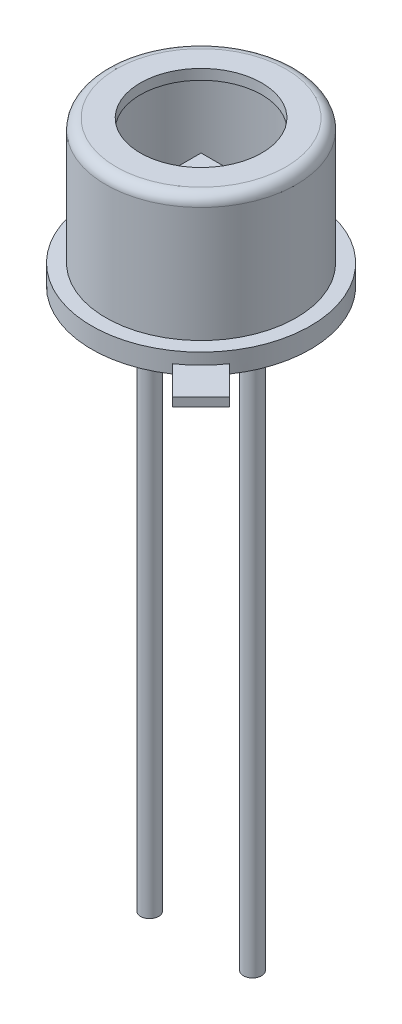
ISO-10303-21;
HEADER;
FILE_DESCRIPTION(('STEP AP214'),'2;1');
FILE_NAME('part.step','',(''),(''),'','','');
FILE_SCHEMA(('AUTOMOTIVE_DESIGN { 1 0 10303 214 1 1 1 1 }'));
ENDSEC;
DATA;
#1=APPLICATION_CONTEXT('core data for automotive mechanical design processes');
#2=APPLICATION_PROTOCOL_DEFINITION('international standard','automotive_design',2000,#1);
#3=PRODUCT_CONTEXT('',#1,'mechanical');
#4=PRODUCT('Part','Part','',(#3));
#5=PRODUCT_RELATED_PRODUCT_CATEGORY('part','',(#4));
#6=PRODUCT_DEFINITION_FORMATION('','',#4);
#7=PRODUCT_DEFINITION_CONTEXT('part definition',#1,'design');
#8=PRODUCT_DEFINITION('design','',#6,#7);
#9=PRODUCT_DEFINITION_SHAPE('','',#8);
#10=(LENGTH_UNIT() NAMED_UNIT(*) SI_UNIT(.MILLI.,.METRE.));
#11=(NAMED_UNIT(*) PLANE_ANGLE_UNIT() SI_UNIT($,.RADIAN.));
#12=(NAMED_UNIT(*) SI_UNIT($,.STERADIAN.) SOLID_ANGLE_UNIT());
#13=UNCERTAINTY_MEASURE_WITH_UNIT(LENGTH_MEASURE(1.E-05),#10,'distance_accuracy_value','');
#14=(GEOMETRIC_REPRESENTATION_CONTEXT(3) GLOBAL_UNCERTAINTY_ASSIGNED_CONTEXT((#13)) GLOBAL_UNIT_ASSIGNED_CONTEXT((#10,
#11,#12)) REPRESENTATION_CONTEXT('',''));
#15=CARTESIAN_POINT('',(0.,0.,0.));
#16=DIRECTION('',(0.,0.,1.));
#17=DIRECTION('',(1.,0.,0.));
#18=AXIS2_PLACEMENT_3D('',#15,#16,#17);
#19=CARTESIAN_POINT('',(-0.55,2.25,0.55));
#20=DIRECTION('',(1.,0.,0.));
#21=DIRECTION('',(0.,0.,-1.));
#22=AXIS2_PLACEMENT_3D('',#19,#20,#21);
#23=PLANE('',#22);
#24=DIRECTION('',(0.,0.,-1.));
#25=VECTOR('',#24,1.);
#26=CARTESIAN_POINT('',(-0.55,2.3,0.55));
#27=LINE('',#26,#25);
#28=CARTESIAN_POINT('',(-0.55,2.3,0.55));
#29=VERTEX_POINT('',#28);
#30=CARTESIAN_POINT('',(-0.55,2.3,-0.55));
#31=VERTEX_POINT('',#30);
#32=EDGE_CURVE('E111',#29,#31,#27,.T.);
#33=ORIENTED_EDGE('',*,*,#32,.T.);
#34=DIRECTION('',(0.,1.,0.));
#35=VECTOR('',#34,1.);
#36=CARTESIAN_POINT('',(-0.55,2.25,-0.55));
#37=LINE('',#36,#35);
#38=CARTESIAN_POINT('',(-0.55,2.25,-0.55));
#39=VERTEX_POINT('',#38);
#40=EDGE_CURVE('E12',#39,#31,#37,.T.);
#41=ORIENTED_EDGE('',*,*,#40,.F.);
#42=DIRECTION('',(0.,0.,-1.));
#43=VECTOR('',#42,1.);
#44=CARTESIAN_POINT('',(-0.55,2.25,0.55));
#45=LINE('',#44,#43);
#46=CARTESIAN_POINT('',(-0.55,2.25,0.55));
#47=VERTEX_POINT('',#46);
#48=EDGE_CURVE('E99',#47,#39,#45,.T.);
#49=ORIENTED_EDGE('',*,*,#48,.F.);
#50=DIRECTION('',(0.,1.,0.));
#51=VECTOR('',#50,1.);
#52=CARTESIAN_POINT('',(-0.55,2.25,0.55));
#53=LINE('',#52,#51);
#54=EDGE_CURVE('E107',#47,#29,#53,.T.);
#55=ORIENTED_EDGE('',*,*,#54,.T.);
#56=EDGE_LOOP('',(#33,#41,#49,#55));
#57=FACE_BOUND('',#56,.T.);
#58=ADVANCED_FACE('F48',(#57),#23,.F.);
#59=CARTESIAN_POINT('',(-0.55,2.25,-0.55));
#60=DIRECTION('',(0.,0.,1.));
#61=DIRECTION('',(1.,0.,0.));
#62=AXIS2_PLACEMENT_3D('',#59,#60,#61);
#63=PLANE('',#62);
#64=DIRECTION('',(1.,0.,0.));
#65=VECTOR('',#64,1.);
#66=CARTESIAN_POINT('',(-0.55,2.3,-0.55));
#67=LINE('',#66,#65);
#68=CARTESIAN_POINT('',(0.55,2.3,-0.55));
#69=VERTEX_POINT('',#68);
#70=EDGE_CURVE('E103',#31,#69,#67,.T.);
#71=ORIENTED_EDGE('',*,*,#70,.T.);
#72=DIRECTION('',(0.,1.,0.));
#73=VECTOR('',#72,1.);
#74=CARTESIAN_POINT('',(0.55,2.25,-0.55));
#75=LINE('',#74,#73);
#76=CARTESIAN_POINT('',(0.55,2.25,-0.55));
#77=VERTEX_POINT('',#76);
#78=EDGE_CURVE('E56',#77,#69,#75,.T.);
#79=ORIENTED_EDGE('',*,*,#78,.F.);
#80=DIRECTION('',(1.,0.,0.));
#81=VECTOR('',#80,1.);
#82=CARTESIAN_POINT('',(-0.55,2.25,-0.55));
#83=LINE('',#82,#81);
#84=EDGE_CURVE('E94',#39,#77,#83,.T.);
#85=ORIENTED_EDGE('',*,*,#84,.F.);
#86=ORIENTED_EDGE('',*,*,#40,.T.);
#87=EDGE_LOOP('',(#71,#79,#85,#86));
#88=FACE_BOUND('',#87,.T.);
#89=ADVANCED_FACE('F102',(#88),#63,.F.);
#90=CARTESIAN_POINT('',(0.55,2.25,0.55));
#91=DIRECTION('',(-1.,0.,0.));
#92=DIRECTION('',(0.,0.,1.));
#93=AXIS2_PLACEMENT_3D('',#90,#91,#92);
#94=PLANE('',#93);
#95=DIRECTION('',(0.,0.,1.));
#96=VECTOR('',#95,1.);
#97=CARTESIAN_POINT('',(0.55,2.3,0.55));
#98=LINE('',#97,#96);
#99=CARTESIAN_POINT('',(0.55,2.3,0.55));
#100=VERTEX_POINT('',#99);
#101=EDGE_CURVE('E81',#69,#100,#98,.T.);
#102=ORIENTED_EDGE('',*,*,#101,.T.);
#103=DIRECTION('',(0.,1.,0.));
#104=VECTOR('',#103,1.);
#105=CARTESIAN_POINT('',(0.55,2.25,0.55));
#106=LINE('',#105,#104);
#107=CARTESIAN_POINT('',(0.55,2.25,0.55));
#108=VERTEX_POINT('',#107);
#109=EDGE_CURVE('E104',#108,#100,#106,.T.);
#110=ORIENTED_EDGE('',*,*,#109,.F.);
#111=DIRECTION('',(0.,0.,1.));
#112=VECTOR('',#111,1.);
#113=CARTESIAN_POINT('',(0.55,2.25,0.55));
#114=LINE('',#113,#112);
#115=EDGE_CURVE('E97',#77,#108,#114,.T.);
#116=ORIENTED_EDGE('',*,*,#115,.F.);
#117=ORIENTED_EDGE('',*,*,#78,.T.);
#118=EDGE_LOOP('',(#102,#110,#116,#117));
#119=FACE_BOUND('',#118,.T.);
#120=ADVANCED_FACE('F105',(#119),#94,.F.);
#121=CARTESIAN_POINT('',(-0.55,2.25,0.55));
#122=DIRECTION('',(0.,0.,-1.));
#123=DIRECTION('',(-1.,0.,0.));
#124=AXIS2_PLACEMENT_3D('',#121,#122,#123);
#125=PLANE('',#124);
#126=DIRECTION('',(-1.,0.,0.));
#127=VECTOR('',#126,1.);
#128=CARTESIAN_POINT('',(-0.55,2.3,0.55));
#129=LINE('',#128,#127);
#130=EDGE_CURVE('E87',#100,#29,#129,.T.);
#131=ORIENTED_EDGE('',*,*,#130,.T.);
#132=ORIENTED_EDGE('',*,*,#54,.F.);
#133=DIRECTION('',(-1.,0.,0.));
#134=VECTOR('',#133,1.);
#135=CARTESIAN_POINT('',(-0.55,2.25,0.55));
#136=LINE('',#135,#134);
#137=EDGE_CURVE('E64',#108,#47,#136,.T.);
#138=ORIENTED_EDGE('',*,*,#137,.F.);
#139=ORIENTED_EDGE('',*,*,#109,.T.);
#140=EDGE_LOOP('',(#131,#132,#138,#139));
#141=FACE_BOUND('',#140,.T.);
#142=ADVANCED_FACE('F118',(#141),#125,.F.);
#143=CARTESIAN_POINT('',(-0.55,2.25,-0.55));
#144=DIRECTION('',(0.,-1.,0.));
#145=DIRECTION('',(0.,0.,-1.));
#146=AXIS2_PLACEMENT_3D('',#143,#144,#145);
#147=PLANE('',#146);
#148=ORIENTED_EDGE('',*,*,#48,.T.);
#149=ORIENTED_EDGE('',*,*,#84,.T.);
#150=ORIENTED_EDGE('',*,*,#115,.T.);
#151=ORIENTED_EDGE('',*,*,#137,.T.);
#152=EDGE_LOOP('',(#148,#149,#150,#151));
#153=FACE_BOUND('',#152,.T.);
#154=ADVANCED_FACE('F95',(#153),#147,.T.);
#155=CARTESIAN_POINT('',(-0.55,2.3,-0.55));
#156=DIRECTION('',(0.,-1.,0.));
#157=DIRECTION('',(0.,0.,-1.));
#158=AXIS2_PLACEMENT_3D('',#155,#156,#157);
#159=PLANE('',#158);
#160=ORIENTED_EDGE('',*,*,#32,.F.);
#161=ORIENTED_EDGE('',*,*,#130,.F.);
#162=ORIENTED_EDGE('',*,*,#101,.F.);
#163=ORIENTED_EDGE('',*,*,#70,.F.);
#164=EDGE_LOOP('',(#160,#161,#162,#163));
#165=FACE_BOUND('',#164,.T.);
#166=ADVANCED_FACE('F121',(#165),#159,.F.);
#167=CLOSED_SHELL('',(#58,#89,#120,#142,#154,#166));
#168=MANIFOLD_SOLID_BREP('B2',#167);
#169=CARTESIAN_POINT('',(2.7,0.,0.));
#170=DIRECTION('',(0.,1.,0.));
#171=DIRECTION('',(0.,0.,1.));
#172=AXIS2_PLACEMENT_3D('',#169,#170,#171);
#173=PLANE('',#172);
#174=CARTESIAN_POINT('',(1.27,0.,0.));
#175=DIRECTION('',(0.,-1.,0.));
#176=DIRECTION('',(0.,0.,-1.));
#177=AXIS2_PLACEMENT_3D('',#174,#175,#176);
#178=CIRCLE('',#177,0.225);
#179=CARTESIAN_POINT('',(1.27,0.,-0.225));
#180=VERTEX_POINT('',#179);
#181=EDGE_CURVE('E280',#180,#180,#178,.F.);
#182=ORIENTED_EDGE('',*,*,#181,.T.);
#183=EDGE_LOOP('',(#182));
#184=FACE_BOUND('',#183,.T.);
#185=CARTESIAN_POINT('',(0.,0.,0.));
#186=DIRECTION('',(0.,-1.,0.));
#187=DIRECTION('',(0.,0.,-1.));
#188=AXIS2_PLACEMENT_3D('',#185,#186,#187);
#189=CIRCLE('',#188,2.7);
#190=CARTESIAN_POINT('',(1.52261291333609,0.,2.22971969452265));
#191=VERTEX_POINT('',#190);
#192=CARTESIAN_POINT('',(2.22971969452265,0.,1.5226129133361));
#193=VERTEX_POINT('',#192);
#194=EDGE_CURVE('E250',#191,#193,#189,.T.);
#195=ORIENTED_EDGE('',*,*,#194,.T.);
#196=DIRECTION('',(0.707106781186546,0.,0.707106781186549));
#197=VECTOR('',#196,1.);
#198=CARTESIAN_POINT('',(2.22971969452265,0.,1.5226129133361));
#199=LINE('',#198,#197);
#200=CARTESIAN_POINT('',(2.93682647570919,0.,2.22971969452265));
#201=VERTEX_POINT('',#200);
#202=EDGE_CURVE('E227',#193,#201,#199,.T.);
#203=ORIENTED_EDGE('',*,*,#202,.T.);
#204=DIRECTION('',(-0.707106781186549,0.,0.707106781186547));
#205=VECTOR('',#204,1.);
#206=CARTESIAN_POINT('',(2.22971969452264,0.,2.93682647570919));
#207=LINE('',#206,#205);
#208=CARTESIAN_POINT('',(2.22971969452264,0.,2.93682647570919));
#209=VERTEX_POINT('',#208);
#210=EDGE_CURVE('E270',#201,#209,#207,.T.);
#211=ORIENTED_EDGE('',*,*,#210,.T.);
#212=DIRECTION('',(-0.707106781186553,0.,-0.707106781186542));
#213=VECTOR('',#212,1.);
#214=CARTESIAN_POINT('',(1.52261291333609,0.,2.22971969452265));
#215=LINE('',#214,#213);
#216=EDGE_CURVE('E188',#209,#191,#215,.T.);
#217=ORIENTED_EDGE('',*,*,#216,.T.);
#218=EDGE_LOOP('',(#195,#203,#211,#217));
#219=FACE_BOUND('',#218,.T.);
#220=CARTESIAN_POINT('',(-1.27,0.,0.));
#221=DIRECTION('',(0.,1.,0.));
#222=DIRECTION('',(0.,0.,1.));
#223=AXIS2_PLACEMENT_3D('',#220,#221,#222);
#224=CIRCLE('',#223,0.225);
#225=CARTESIAN_POINT('',(-1.27,0.,0.225));
#226=VERTEX_POINT('',#225);
#227=EDGE_CURVE('E46',#226,#226,#224,.F.);
#228=ORIENTED_EDGE('',*,*,#227,.F.);
#229=EDGE_LOOP('',(#228));
#230=FACE_BOUND('',#229,.T.);
#231=ADVANCED_FACE('F173',(#184,#219,#230),#173,.F.);
#232=CARTESIAN_POINT('',(2.096,3.6,0.));
#233=DIRECTION('',(0.,1.,0.));
#234=DIRECTION('',(0.,0.,1.));
#235=AXIS2_PLACEMENT_3D('',#232,#233,#234);
#236=PLANE('',#235);
#237=CARTESIAN_POINT('',(0.,3.6,0.));
#238=DIRECTION('',(0.,-1.,0.));
#239=DIRECTION('',(0.,0.,-1.));
#240=AXIS2_PLACEMENT_3D('',#237,#238,#239);
#241=CIRCLE('',#240,1.5);
#242=CARTESIAN_POINT('',(0.,3.6,-1.5));
#243=VERTEX_POINT('',#242);
#244=EDGE_CURVE('E240',#243,#243,#241,.T.);
#245=ORIENTED_EDGE('',*,*,#244,.T.);
#246=EDGE_LOOP('',(#245));
#247=FACE_BOUND('',#246,.T.);
#248=CARTESIAN_POINT('',(0.,3.6,0.));
#249=DIRECTION('',(0.,-1.,0.));
#250=DIRECTION('',(0.,0.,-1.));
#251=AXIS2_PLACEMENT_3D('',#248,#249,#250);
#252=CIRCLE('',#251,2.096);
#253=CARTESIAN_POINT('',(0.,3.6,-2.096));
#254=VERTEX_POINT('',#253);
#255=EDGE_CURVE('E261',#254,#254,#252,.T.);
#256=ORIENTED_EDGE('',*,*,#255,.F.);
#257=EDGE_LOOP('',(#256));
#258=FACE_BOUND('',#257,.T.);
#259=ADVANCED_FACE('F175',(#247,#258),#236,.T.);
#260=CARTESIAN_POINT('',(0.,0.,0.));
#261=DIRECTION('',(0.,-1.,0.));
#262=DIRECTION('',(0.,0.,-1.));
#263=AXIS2_PLACEMENT_3D('',#260,#261,#262);
#264=CYLINDRICAL_SURFACE('',#263,1.5);
#265=ORIENTED_EDGE('',*,*,#244,.F.);
#266=EDGE_LOOP('',(#265));
#267=FACE_BOUND('',#266,.T.);
#268=CARTESIAN_POINT('',(0.,3.346,0.));
#269=DIRECTION('',(0.,-1.,0.));
#270=DIRECTION('',(0.,0.,-1.));
#271=AXIS2_PLACEMENT_3D('',#268,#269,#270);
#272=CIRCLE('',#271,1.5);
#273=CARTESIAN_POINT('',(0.,3.346,-1.5));
#274=VERTEX_POINT('',#273);
#275=EDGE_CURVE('E242',#274,#274,#272,.T.);
#276=ORIENTED_EDGE('',*,*,#275,.T.);
#277=EDGE_LOOP('',(#276));
#278=FACE_BOUND('',#277,.T.);
#279=ADVANCED_FACE('F303',(#267,#278),#264,.F.);
#280=CARTESIAN_POINT('',(2.096,3.346,0.));
#281=DIRECTION('',(0.,1.,0.));
#282=DIRECTION('',(0.,0.,1.));
#283=AXIS2_PLACEMENT_3D('',#280,#281,#282);
#284=PLANE('',#283);
#285=ORIENTED_EDGE('',*,*,#275,.F.);
#286=EDGE_LOOP('',(#285));
#287=FACE_BOUND('',#286,.T.);
#288=CARTESIAN_POINT('',(0.,3.346,0.));
#289=DIRECTION('',(0.,-1.,0.));
#290=DIRECTION('',(0.,0.,-1.));
#291=AXIS2_PLACEMENT_3D('',#288,#289,#290);
#292=CIRCLE('',#291,2.096);
#293=CARTESIAN_POINT('',(0.,3.346,-2.096));
#294=VERTEX_POINT('',#293);
#295=EDGE_CURVE('E247',#294,#294,#292,.T.);
#296=ORIENTED_EDGE('',*,*,#295,.T.);
#297=EDGE_LOOP('',(#296));
#298=FACE_BOUND('',#297,.T.);
#299=ADVANCED_FACE('F311',(#287,#298),#284,.F.);
#300=CARTESIAN_POINT('',(0.,0.,0.));
#301=DIRECTION('',(0.,-1.,0.));
#302=DIRECTION('',(0.,0.,-1.));
#303=AXIS2_PLACEMENT_3D('',#300,#301,#302);
#304=CYLINDRICAL_SURFACE('',#303,2.096);
#305=ORIENTED_EDGE('',*,*,#295,.F.);
#306=EDGE_LOOP('',(#305));
#307=FACE_BOUND('',#306,.T.);
#308=CARTESIAN_POINT('',(0.,0.246,0.));
#309=DIRECTION('',(0.,1.,0.));
#310=DIRECTION('',(0.,0.,1.));
#311=AXIS2_PLACEMENT_3D('',#308,#309,#310);
#312=CIRCLE('',#311,2.096);
#313=CARTESIAN_POINT('',(0.,0.246,2.096));
#314=VERTEX_POINT('',#313);
#315=EDGE_CURVE('E264',#314,#314,#312,.F.);
#316=ORIENTED_EDGE('',*,*,#315,.T.);
#317=EDGE_LOOP('',(#316));
#318=FACE_BOUND('',#317,.T.);
#319=ADVANCED_FACE('F308',(#307,#318),#304,.F.);
#320=CARTESIAN_POINT('',(0.,0.,0.));
#321=DIRECTION('',(0.,-1.,0.));
#322=DIRECTION('',(0.,0.,-1.));
#323=AXIS2_PLACEMENT_3D('',#320,#321,#322);
#324=CYLINDRICAL_SURFACE('',#323,2.7);
#325=DIRECTION('',(0.,-1.,0.));
#326=VECTOR('',#325,1.);
#327=CARTESIAN_POINT('',(2.22971969452265,0.22,1.5226129133361));
#328=LINE('',#327,#326);
#329=CARTESIAN_POINT('',(2.22971969452265,0.22,1.5226129133361));
#330=VERTEX_POINT('',#329);
#331=EDGE_CURVE('E222',#330,#193,#328,.T.);
#332=ORIENTED_EDGE('',*,*,#331,.T.);
#333=ORIENTED_EDGE('',*,*,#194,.F.);
#334=DIRECTION('',(0.,-1.,0.));
#335=VECTOR('',#334,1.);
#336=CARTESIAN_POINT('',(1.52261291333609,0.22,2.22971969452265));
#337=LINE('',#336,#335);
#338=CARTESIAN_POINT('',(1.52261291333609,0.22,2.22971969452265));
#339=VERTEX_POINT('',#338);
#340=EDGE_CURVE('E231',#339,#191,#337,.T.);
#341=ORIENTED_EDGE('',*,*,#340,.F.);
#342=CARTESIAN_POINT('',(0.,0.22,0.));
#343=DIRECTION('',(0.,1.,0.));
#344=DIRECTION('',(0.,0.,1.));
#345=AXIS2_PLACEMENT_3D('',#342,#343,#344);
#346=CIRCLE('',#345,2.7);
#347=EDGE_CURVE('E181',#330,#339,#346,.F.);
#348=ORIENTED_EDGE('',*,*,#347,.F.);
#349=EDGE_LOOP('',(#332,#333,#341,#348));
#350=FACE_BOUND('',#349,.T.);
#351=CARTESIAN_POINT('',(0.,0.5,0.));
#352=DIRECTION('',(0.,-1.,0.));
#353=DIRECTION('',(0.,0.,-1.));
#354=AXIS2_PLACEMENT_3D('',#351,#352,#353);
#355=CIRCLE('',#354,2.7);
#356=CARTESIAN_POINT('',(0.,0.5,-2.7));
#357=VERTEX_POINT('',#356);
#358=EDGE_CURVE('E252',#357,#357,#355,.T.);
#359=ORIENTED_EDGE('',*,*,#358,.T.);
#360=EDGE_LOOP('',(#359));
#361=FACE_BOUND('',#360,.T.);
#362=ADVANCED_FACE('F238',(#350,#361),#324,.T.);
#363=CARTESIAN_POINT('',(2.7,0.5,0.));
#364=DIRECTION('',(0.,1.,0.));
#365=DIRECTION('',(0.,0.,1.));
#366=AXIS2_PLACEMENT_3D('',#363,#364,#365);
#367=PLANE('',#366);
#368=CARTESIAN_POINT('',(0.,0.5,0.));
#369=DIRECTION('',(0.,-1.,0.));
#370=DIRECTION('',(0.,0.,-1.));
#371=AXIS2_PLACEMENT_3D('',#368,#369,#370);
#372=CIRCLE('',#371,2.35);
#373=CARTESIAN_POINT('',(0.,0.5,-2.35));
#374=VERTEX_POINT('',#373);
#375=EDGE_CURVE('E255',#374,#374,#372,.T.);
#376=ORIENTED_EDGE('',*,*,#375,.T.);
#377=EDGE_LOOP('',(#376));
#378=FACE_BOUND('',#377,.T.);
#379=ORIENTED_EDGE('',*,*,#358,.F.);
#380=EDGE_LOOP('',(#379));
#381=FACE_BOUND('',#380,.T.);
#382=ADVANCED_FACE('F344',(#378,#381),#367,.T.);
#383=CARTESIAN_POINT('',(0.,0.,0.));
#384=DIRECTION('',(0.,-1.,0.));
#385=DIRECTION('',(0.,0.,-1.));
#386=AXIS2_PLACEMENT_3D('',#383,#384,#385);
#387=CYLINDRICAL_SURFACE('',#386,2.35);
#388=CARTESIAN_POINT('',(0.,3.346,0.));
#389=DIRECTION('',(0.,-1.,0.));
#390=DIRECTION('',(0.,0.,-1.));
#391=AXIS2_PLACEMENT_3D('',#388,#389,#390);
#392=CIRCLE('',#391,2.35);
#393=CARTESIAN_POINT('',(0.,3.346,-2.35));
#394=VERTEX_POINT('',#393);
#395=EDGE_CURVE('E258',#394,#394,#392,.T.);
#396=ORIENTED_EDGE('',*,*,#395,.T.);
#397=EDGE_LOOP('',(#396));
#398=FACE_BOUND('',#397,.T.);
#399=ORIENTED_EDGE('',*,*,#375,.F.);
#400=EDGE_LOOP('',(#399));
#401=FACE_BOUND('',#400,.T.);
#402=ADVANCED_FACE('F338',(#398,#401),#387,.T.);
#403=CARTESIAN_POINT('',(0.,3.346,0.));
#404=DIRECTION('',(0.,-1.,0.));
#405=DIRECTION('',(0.,0.,-1.));
#406=AXIS2_PLACEMENT_3D('',#403,#404,#405);
#407=TOROIDAL_SURFACE('',#406,2.096,0.254);
#408=ORIENTED_EDGE('',*,*,#255,.T.);
#409=EDGE_LOOP('',(#408));
#410=FACE_BOUND('',#409,.T.);
#411=ORIENTED_EDGE('',*,*,#395,.F.);
#412=EDGE_LOOP('',(#411));
#413=FACE_BOUND('',#412,.T.);
#414=ADVANCED_FACE('F330',(#410,#413),#407,.T.);
#415=CARTESIAN_POINT('',(2.7,0.246,0.));
#416=DIRECTION('',(0.,1.,0.));
#417=DIRECTION('',(0.,0.,1.));
#418=AXIS2_PLACEMENT_3D('',#415,#416,#417);
#419=PLANE('',#418);
#420=ORIENTED_EDGE('',*,*,#315,.F.);
#421=EDGE_LOOP('',(#420));
#422=FACE_BOUND('',#421,.T.);
#423=ADVANCED_FACE('F327',(#422),#419,.T.);
#424=CARTESIAN_POINT('',(1.52261291333609,0.22,2.22971969452265));
#425=DIRECTION('',(-0.707106781186542,0.,0.707106781186553));
#426=DIRECTION('',(0.707106781186553,0.,0.707106781186542));
#427=AXIS2_PLACEMENT_3D('',#424,#425,#426);
#428=PLANE('',#427);
#429=ORIENTED_EDGE('',*,*,#216,.F.);
#430=DIRECTION('',(0.,-1.,0.));
#431=VECTOR('',#430,1.);
#432=CARTESIAN_POINT('',(2.22971969452264,0.22,2.93682647570919));
#433=LINE('',#432,#431);
#434=CARTESIAN_POINT('',(2.22971969452264,0.22,2.93682647570919));
#435=VERTEX_POINT('',#434);
#436=EDGE_CURVE('E196',#435,#209,#433,.T.);
#437=ORIENTED_EDGE('',*,*,#436,.F.);
#438=DIRECTION('',(-0.707106781186553,0.,-0.707106781186542));
#439=VECTOR('',#438,1.);
#440=CARTESIAN_POINT('',(1.52261291333609,0.22,2.22971969452265));
#441=LINE('',#440,#439);
#442=EDGE_CURVE('E235',#435,#339,#441,.T.);
#443=ORIENTED_EDGE('',*,*,#442,.T.);
#444=ORIENTED_EDGE('',*,*,#340,.T.);
#445=EDGE_LOOP('',(#429,#437,#443,#444));
#446=FACE_BOUND('',#445,.T.);
#447=ADVANCED_FACE('F329',(#446),#428,.T.);
#448=CARTESIAN_POINT('',(2.22971969452264,0.22,2.93682647570919));
#449=DIRECTION('',(0.707106781186547,0.,0.707106781186548));
#450=DIRECTION('',(0.707106781186548,0.,-0.707106781186547));
#451=AXIS2_PLACEMENT_3D('',#448,#449,#450);
#452=PLANE('',#451);
#453=ORIENTED_EDGE('',*,*,#210,.F.);
#454=DIRECTION('',(0.,-1.,0.));
#455=VECTOR('',#454,1.);
#456=CARTESIAN_POINT('',(2.93682647570919,0.22,2.22971969452265));
#457=LINE('',#456,#455);
#458=CARTESIAN_POINT('',(2.93682647570919,0.22,2.22971969452265));
#459=VERTEX_POINT('',#458);
#460=EDGE_CURVE('E230',#459,#201,#457,.T.);
#461=ORIENTED_EDGE('',*,*,#460,.F.);
#462=DIRECTION('',(-0.707106781186549,0.,0.707106781186547));
#463=VECTOR('',#462,1.);
#464=CARTESIAN_POINT('',(2.22971969452264,0.22,2.93682647570919));
#465=LINE('',#464,#463);
#466=EDGE_CURVE('E234',#459,#435,#465,.T.);
#467=ORIENTED_EDGE('',*,*,#466,.T.);
#468=ORIENTED_EDGE('',*,*,#436,.T.);
#469=EDGE_LOOP('',(#453,#461,#467,#468));
#470=FACE_BOUND('',#469,.T.);
#471=ADVANCED_FACE('F336',(#470),#452,.T.);
#472=CARTESIAN_POINT('',(2.22971969452265,0.22,1.5226129133361));
#473=DIRECTION('',(0.707106781186549,0.,-0.707106781186546));
#474=DIRECTION('',(-0.707106781186546,0.,-0.707106781186549));
#475=AXIS2_PLACEMENT_3D('',#472,#473,#474);
#476=PLANE('',#475);
#477=ORIENTED_EDGE('',*,*,#202,.F.);
#478=ORIENTED_EDGE('',*,*,#331,.F.);
#479=DIRECTION('',(0.707106781186546,0.,0.707106781186549));
#480=VECTOR('',#479,1.);
#481=CARTESIAN_POINT('',(2.22971969452265,0.22,1.5226129133361));
#482=LINE('',#481,#480);
#483=EDGE_CURVE('E224',#330,#459,#482,.T.);
#484=ORIENTED_EDGE('',*,*,#483,.T.);
#485=ORIENTED_EDGE('',*,*,#460,.T.);
#486=EDGE_LOOP('',(#477,#478,#484,#485));
#487=FACE_BOUND('',#486,.T.);
#488=ADVANCED_FACE('F223',(#487),#476,.T.);
#489=CARTESIAN_POINT('',(2.22971969452264,0.22,2.93682647570919));
#490=DIRECTION('',(0.,1.,0.));
#491=DIRECTION('',(0.,0.,1.));
#492=AXIS2_PLACEMENT_3D('',#489,#490,#491);
#493=PLANE('',#492);
#494=ORIENTED_EDGE('',*,*,#483,.F.);
#495=ORIENTED_EDGE('',*,*,#347,.T.);
#496=ORIENTED_EDGE('',*,*,#442,.F.);
#497=ORIENTED_EDGE('',*,*,#466,.F.);
#498=EDGE_LOOP('',(#494,#495,#496,#497));
#499=FACE_BOUND('',#498,.T.);
#500=ADVANCED_FACE('F233',(#499),#493,.T.);
#501=CARTESIAN_POINT('',(-1.27,-14.,0.));
#502=DIRECTION('',(0.,1.,0.));
#503=DIRECTION('',(0.,0.,1.));
#504=AXIS2_PLACEMENT_3D('',#501,#502,#503);
#505=CYLINDRICAL_SURFACE('',#504,0.225);
#506=CARTESIAN_POINT('',(-1.27,-14.,0.));
#507=DIRECTION('',(0.,-1.,0.));
#508=DIRECTION('',(0.,0.,-1.));
#509=AXIS2_PLACEMENT_3D('',#506,#507,#508);
#510=CIRCLE('',#509,0.225);
#511=CARTESIAN_POINT('',(-1.27,-14.,-0.225));
#512=VERTEX_POINT('',#511);
#513=EDGE_CURVE('E274',#512,#512,#510,.T.);
#514=ORIENTED_EDGE('',*,*,#513,.F.);
#515=EDGE_LOOP('',(#514));
#516=FACE_BOUND('',#515,.T.);
#517=ORIENTED_EDGE('',*,*,#227,.T.);
#518=EDGE_LOOP('',(#517));
#519=FACE_BOUND('',#518,.T.);
#520=ADVANCED_FACE('F426',(#516,#519),#505,.T.);
#521=CARTESIAN_POINT('',(0.,-14.,0.));
#522=DIRECTION('',(0.,-1.,0.));
#523=DIRECTION('',(0.,0.,-1.));
#524=AXIS2_PLACEMENT_3D('',#521,#522,#523);
#525=PLANE('',#524);
#526=ORIENTED_EDGE('',*,*,#513,.T.);
#527=EDGE_LOOP('',(#526));
#528=FACE_BOUND('',#527,.T.);
#529=ADVANCED_FACE('F295',(#528),#525,.T.);
#530=CARTESIAN_POINT('',(1.27,-14.,0.));
#531=DIRECTION('',(0.,1.,0.));
#532=DIRECTION('',(0.,0.,1.));
#533=AXIS2_PLACEMENT_3D('',#530,#531,#532);
#534=CYLINDRICAL_SURFACE('',#533,0.225);
#535=CARTESIAN_POINT('',(1.27,-14.,0.));
#536=DIRECTION('',(0.,-1.,0.));
#537=DIRECTION('',(0.,0.,-1.));
#538=AXIS2_PLACEMENT_3D('',#535,#536,#537);
#539=CIRCLE('',#538,0.225);
#540=CARTESIAN_POINT('',(1.27,-14.,-0.225));
#541=VERTEX_POINT('',#540);
#542=EDGE_CURVE('E279',#541,#541,#539,.F.);
#543=ORIENTED_EDGE('',*,*,#542,.T.);
#544=EDGE_LOOP('',(#543));
#545=FACE_BOUND('',#544,.T.);
#546=ORIENTED_EDGE('',*,*,#181,.F.);
#547=EDGE_LOOP('',(#546));
#548=FACE_BOUND('',#547,.T.);
#549=ADVANCED_FACE('F286',(#545,#548),#534,.T.);
#550=CARTESIAN_POINT('',(0.,-14.,0.));
#551=DIRECTION('',(0.,-1.,0.));
#552=DIRECTION('',(0.,0.,-1.));
#553=AXIS2_PLACEMENT_3D('',#550,#551,#552);
#554=PLANE('',#553);
#555=ORIENTED_EDGE('',*,*,#542,.F.);
#556=EDGE_LOOP('',(#555));
#557=FACE_BOUND('',#556,.T.);
#558=ADVANCED_FACE('F289',(#557),#554,.T.);
#559=CLOSED_SHELL('',(#231,#259,#279,#299,#319,#362,#382,#402,#414,#423,#447,#471,#488,#500,
#520,#529,#549,#558));
#560=MANIFOLD_SOLID_BREP('B6',#559);
#561=ADVANCED_BREP_SHAPE_REPRESENTATION('',(#18,#168,#560),#14);
#562=SHAPE_DEFINITION_REPRESENTATION(#9,#561);
ENDSEC;
END-ISO-10303-21;
